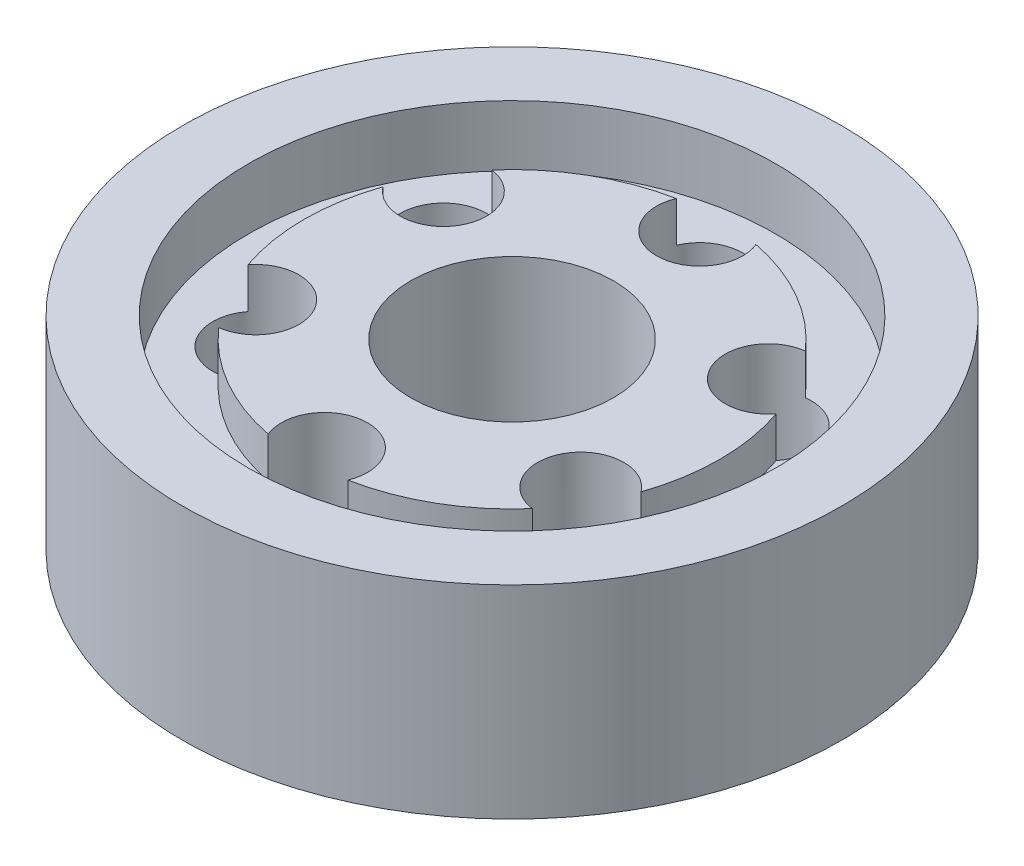
ISO-10303-21;
HEADER;
FILE_DESCRIPTION(('STEP AP214'),'2;1');
FILE_NAME('part.step','',(''),(''),'','','');
FILE_SCHEMA(('AUTOMOTIVE_DESIGN { 1 0 10303 214 1 1 1 1 }'));
ENDSEC;
DATA;
#1=APPLICATION_CONTEXT('core data for automotive mechanical design processes');
#2=APPLICATION_PROTOCOL_DEFINITION('international standard','automotive_design',2000,#1);
#3=PRODUCT_CONTEXT('',#1,'mechanical');
#4=PRODUCT('Part','Part','',(#3));
#5=PRODUCT_RELATED_PRODUCT_CATEGORY('part','',(#4));
#6=PRODUCT_DEFINITION_FORMATION('','',#4);
#7=PRODUCT_DEFINITION_CONTEXT('part definition',#1,'design');
#8=PRODUCT_DEFINITION('design','',#6,#7);
#9=PRODUCT_DEFINITION_SHAPE('','',#8);
#10=(LENGTH_UNIT() NAMED_UNIT(*) SI_UNIT(.MILLI.,.METRE.));
#11=(NAMED_UNIT(*) PLANE_ANGLE_UNIT() SI_UNIT($,.RADIAN.));
#12=(NAMED_UNIT(*) SI_UNIT($,.STERADIAN.) SOLID_ANGLE_UNIT());
#13=UNCERTAINTY_MEASURE_WITH_UNIT(LENGTH_MEASURE(1.E-05),#10,'distance_accuracy_value','');
#14=(GEOMETRIC_REPRESENTATION_CONTEXT(3) GLOBAL_UNCERTAINTY_ASSIGNED_CONTEXT((#13)) GLOBAL_UNIT_ASSIGNED_CONTEXT((#10,
#11,#12)) REPRESENTATION_CONTEXT('',''));
#15=CARTESIAN_POINT('',(0.,0.,0.));
#16=DIRECTION('',(0.,0.,1.));
#17=DIRECTION('',(1.,0.,0.));
#18=AXIS2_PLACEMENT_3D('',#15,#16,#17);
#19=CARTESIAN_POINT('',(0.,14.,0.));
#20=DIRECTION('',(0.,1.,0.));
#21=DIRECTION('',(0.,0.,1.));
#22=AXIS2_PLACEMENT_3D('',#19,#20,#21);
#23=CYLINDRICAL_SURFACE('',#22,26.);
#24=CARTESIAN_POINT('',(0.,20.,0.));
#25=DIRECTION('',(0.,1.,0.));
#26=DIRECTION('',(0.,0.,1.));
#27=AXIS2_PLACEMENT_3D('',#24,#25,#26);
#28=CIRCLE('',#27,26.);
#29=CARTESIAN_POINT('',(0.,20.,26.));
#30=VERTEX_POINT('',#29);
#31=EDGE_CURVE('E169',#30,#30,#28,.F.);
#32=ORIENTED_EDGE('',*,*,#31,.F.);
#33=EDGE_LOOP('',(#32));
#34=FACE_BOUND('',#33,.T.);
#35=CARTESIAN_POINT('',(0.,14.,0.));
#36=DIRECTION('',(0.,1.,0.));
#37=DIRECTION('',(0.,0.,1.));
#38=AXIS2_PLACEMENT_3D('',#35,#36,#37);
#39=CIRCLE('',#38,26.);
#40=CARTESIAN_POINT('',(0.,14.,26.));
#41=VERTEX_POINT('',#40);
#42=EDGE_CURVE('E211',#41,#41,#39,.T.);
#43=ORIENTED_EDGE('',*,*,#42,.F.);
#44=EDGE_LOOP('',(#43));
#45=FACE_BOUND('',#44,.T.);
#46=ADVANCED_FACE('F15',(#34,#45),#23,.F.);
#47=CARTESIAN_POINT('',(0.,18.,0.));
#48=DIRECTION('',(0.,-1.,0.));
#49=DIRECTION('',(0.,0.,-1.));
#50=AXIS2_PLACEMENT_3D('',#47,#48,#49);
#51=CYLINDRICAL_SURFACE('',#50,20.5);
#52=CARTESIAN_POINT('',(0.,18.,0.));
#53=DIRECTION('',(0.,-1.,0.));
#54=DIRECTION('',(0.,0.,-1.));
#55=AXIS2_PLACEMENT_3D('',#52,#53,#54);
#56=CIRCLE('',#55,20.5);
#57=CARTESIAN_POINT('',(-19.3889539201822,18.,-6.65721156949743));
#58=VERTEX_POINT('',#57);
#59=CARTESIAN_POINT('',(-19.3889539201821,18.,6.65721156949784));
#60=VERTEX_POINT('',#59);
#61=EDGE_CURVE('E229',#58,#60,#56,.F.);
#62=ORIENTED_EDGE('',*,*,#61,.F.);
#63=DIRECTION('',(0.,-1.,0.));
#64=VECTOR('',#63,1.);
#65=CARTESIAN_POINT('',(-19.3889539201822,0.,-6.65721156949742));
#66=LINE('',#65,#64);
#67=CARTESIAN_POINT('',(-19.3889539201822,14.,-6.65721156949743));
#68=VERTEX_POINT('',#67);
#69=EDGE_CURVE('E161',#58,#68,#66,.T.);
#70=ORIENTED_EDGE('',*,*,#69,.T.);
#71=CARTESIAN_POINT('',(0.,14.,0.));
#72=DIRECTION('',(0.,-1.,0.));
#73=DIRECTION('',(0.,0.,-1.));
#74=AXIS2_PLACEMENT_3D('',#71,#72,#73);
#75=CIRCLE('',#74,20.5);
#76=CARTESIAN_POINT('',(-19.3889539201821,14.,6.65721156949784));
#77=VERTEX_POINT('',#76);
#78=EDGE_CURVE('E224',#77,#68,#75,.T.);
#79=ORIENTED_EDGE('',*,*,#78,.F.);
#80=DIRECTION('',(0.,-1.,0.));
#81=VECTOR('',#80,1.);
#82=CARTESIAN_POINT('',(-19.3889539201821,0.,6.65721156949784));
#83=LINE('',#82,#81);
#84=EDGE_CURVE('E167',#77,#60,#83,.F.);
#85=ORIENTED_EDGE('',*,*,#84,.T.);
#86=EDGE_LOOP('',(#62,#70,#79,#85));
#87=FACE_BOUND('',#86,.T.);
#88=ADVANCED_FACE('F309',(#87),#51,.T.);
#89=CARTESIAN_POINT('',(0.,18.,0.));
#90=DIRECTION('',(0.,-1.,0.));
#91=DIRECTION('',(0.,0.,-1.));
#92=AXIS2_PLACEMENT_3D('',#89,#90,#91);
#93=CYLINDRICAL_SURFACE('',#92,20.5);
#94=CARTESIAN_POINT('',(0.,18.,0.));
#95=DIRECTION('',(0.,-1.,0.));
#96=DIRECTION('',(0.,0.,-1.));
#97=AXIS2_PLACEMENT_3D('',#94,#95,#96);
#98=CIRCLE('',#97,20.5);
#99=CARTESIAN_POINT('',(-3.92916262253848,18.,-20.1199324324324));
#100=VERTEX_POINT('',#99);
#101=CARTESIAN_POINT('',(-15.4597912976438,18.,-13.4627208629347));
#102=VERTEX_POINT('',#101);
#103=EDGE_CURVE('E231',#100,#102,#98,.F.);
#104=ORIENTED_EDGE('',*,*,#103,.F.);
#105=DIRECTION('',(0.,-1.,0.));
#106=VECTOR('',#105,1.);
#107=CARTESIAN_POINT('',(-3.92916262253848,0.,-20.1199324324324));
#108=LINE('',#107,#106);
#109=CARTESIAN_POINT('',(-3.92916262253848,14.,-20.1199324324324));
#110=VERTEX_POINT('',#109);
#111=EDGE_CURVE('E153',#100,#110,#108,.T.);
#112=ORIENTED_EDGE('',*,*,#111,.T.);
#113=CARTESIAN_POINT('',(0.,14.,0.));
#114=DIRECTION('',(0.,-1.,0.));
#115=DIRECTION('',(0.,0.,-1.));
#116=AXIS2_PLACEMENT_3D('',#113,#114,#115);
#117=CIRCLE('',#116,20.5);
#118=CARTESIAN_POINT('',(-15.4597912976438,14.,-13.4627208629347));
#119=VERTEX_POINT('',#118);
#120=EDGE_CURVE('E221',#119,#110,#117,.T.);
#121=ORIENTED_EDGE('',*,*,#120,.F.);
#122=DIRECTION('',(0.,-1.,0.));
#123=VECTOR('',#122,1.);
#124=CARTESIAN_POINT('',(-15.4597912976438,0.,-13.4627208629347));
#125=LINE('',#124,#123);
#126=EDGE_CURVE('E157',#119,#102,#125,.F.);
#127=ORIENTED_EDGE('',*,*,#126,.T.);
#128=EDGE_LOOP('',(#104,#112,#121,#127));
#129=FACE_BOUND('',#128,.T.);
#130=ADVANCED_FACE('F314',(#129),#93,.T.);
#131=CARTESIAN_POINT('',(0.,18.,0.));
#132=DIRECTION('',(0.,-1.,0.));
#133=DIRECTION('',(0.,0.,-1.));
#134=AXIS2_PLACEMENT_3D('',#131,#132,#133);
#135=CYLINDRICAL_SURFACE('',#134,20.5);
#136=CARTESIAN_POINT('',(0.,18.,0.));
#137=DIRECTION('',(0.,-1.,0.));
#138=DIRECTION('',(0.,0.,-1.));
#139=AXIS2_PLACEMENT_3D('',#136,#137,#138);
#140=CIRCLE('',#139,20.5);
#141=CARTESIAN_POINT('',(15.4597912976436,18.,-13.4627208629349));
#142=VERTEX_POINT('',#141);
#143=CARTESIAN_POINT('',(3.92916262253848,18.,-20.1199324324324));
#144=VERTEX_POINT('',#143);
#145=EDGE_CURVE('E233',#142,#144,#140,.F.);
#146=ORIENTED_EDGE('',*,*,#145,.F.);
#147=DIRECTION('',(0.,-1.,0.));
#148=VECTOR('',#147,1.);
#149=CARTESIAN_POINT('',(15.4597912976436,0.,-13.4627208629349));
#150=LINE('',#149,#148);
#151=CARTESIAN_POINT('',(15.4597912976436,14.,-13.4627208629349));
#152=VERTEX_POINT('',#151);
#153=EDGE_CURVE('E145',#142,#152,#150,.T.);
#154=ORIENTED_EDGE('',*,*,#153,.T.);
#155=CARTESIAN_POINT('',(0.,14.,0.));
#156=DIRECTION('',(0.,-1.,0.));
#157=DIRECTION('',(0.,0.,-1.));
#158=AXIS2_PLACEMENT_3D('',#155,#156,#157);
#159=CIRCLE('',#158,20.5);
#160=CARTESIAN_POINT('',(3.92916262253848,14.,-20.1199324324324));
#161=VERTEX_POINT('',#160);
#162=EDGE_CURVE('E218',#161,#152,#159,.T.);
#163=ORIENTED_EDGE('',*,*,#162,.F.);
#164=DIRECTION('',(0.,-1.,0.));
#165=VECTOR('',#164,1.);
#166=CARTESIAN_POINT('',(3.92916262253848,0.,-20.1199324324324));
#167=LINE('',#166,#165);
#168=EDGE_CURVE('E149',#161,#144,#167,.F.);
#169=ORIENTED_EDGE('',*,*,#168,.T.);
#170=EDGE_LOOP('',(#146,#154,#163,#169));
#171=FACE_BOUND('',#170,.T.);
#172=ADVANCED_FACE('F319',(#171),#135,.T.);
#173=CARTESIAN_POINT('',(0.,18.,0.));
#174=DIRECTION('',(0.,-1.,0.));
#175=DIRECTION('',(0.,0.,-1.));
#176=AXIS2_PLACEMENT_3D('',#173,#174,#175);
#177=CYLINDRICAL_SURFACE('',#176,20.5);
#178=CARTESIAN_POINT('',(0.,18.,0.));
#179=DIRECTION('',(0.,-1.,0.));
#180=DIRECTION('',(0.,0.,-1.));
#181=AXIS2_PLACEMENT_3D('',#178,#179,#180);
#182=CIRCLE('',#181,20.5);
#183=CARTESIAN_POINT('',(19.3889539201822,18.,6.65721156949756));
#184=VERTEX_POINT('',#183);
#185=CARTESIAN_POINT('',(19.3889539201821,18.,-6.65721156949769));
#186=VERTEX_POINT('',#185);
#187=EDGE_CURVE('E124',#184,#186,#182,.F.);
#188=ORIENTED_EDGE('',*,*,#187,.F.);
#189=DIRECTION('',(0.,-1.,0.));
#190=VECTOR('',#189,1.);
#191=CARTESIAN_POINT('',(19.3889539201822,0.,6.65721156949756));
#192=LINE('',#191,#190);
#193=CARTESIAN_POINT('',(19.3889539201822,14.,6.65721156949756));
#194=VERTEX_POINT('',#193);
#195=EDGE_CURVE('E133',#184,#194,#192,.T.);
#196=ORIENTED_EDGE('',*,*,#195,.T.);
#197=CARTESIAN_POINT('',(0.,14.,0.));
#198=DIRECTION('',(0.,-1.,0.));
#199=DIRECTION('',(0.,0.,-1.));
#200=AXIS2_PLACEMENT_3D('',#197,#198,#199);
#201=CIRCLE('',#200,20.5);
#202=CARTESIAN_POINT('',(19.3889539201821,14.,-6.65721156949769));
#203=VERTEX_POINT('',#202);
#204=EDGE_CURVE('E216',#203,#194,#201,.T.);
#205=ORIENTED_EDGE('',*,*,#204,.F.);
#206=DIRECTION('',(0.,-1.,0.));
#207=VECTOR('',#206,1.);
#208=CARTESIAN_POINT('',(19.3889539201821,0.,-6.65721156949769));
#209=LINE('',#208,#207);
#210=EDGE_CURVE('E141',#203,#186,#209,.F.);
#211=ORIENTED_EDGE('',*,*,#210,.T.);
#212=EDGE_LOOP('',(#188,#196,#205,#211));
#213=FACE_BOUND('',#212,.T.);
#214=ADVANCED_FACE('F243',(#213),#177,.T.);
#215=CARTESIAN_POINT('',(0.,18.,0.));
#216=DIRECTION('',(0.,-1.,0.));
#217=DIRECTION('',(0.,0.,-1.));
#218=AXIS2_PLACEMENT_3D('',#215,#216,#217);
#219=CYLINDRICAL_SURFACE('',#218,20.5);
#220=CARTESIAN_POINT('',(0.,14.,0.));
#221=DIRECTION('',(0.,-1.,0.));
#222=DIRECTION('',(0.,0.,-1.));
#223=AXIS2_PLACEMENT_3D('',#220,#221,#222);
#224=CIRCLE('',#223,20.5);
#225=CARTESIAN_POINT('',(-3.92916262253848,14.,20.1199324324324));
#226=VERTEX_POINT('',#225);
#227=CARTESIAN_POINT('',(-15.4597912976435,14.,13.462720862935));
#228=VERTEX_POINT('',#227);
#229=EDGE_CURVE('E102',#226,#228,#224,.T.);
#230=ORIENTED_EDGE('',*,*,#229,.F.);
#231=DIRECTION('',(0.,-1.,0.));
#232=VECTOR('',#231,1.);
#233=CARTESIAN_POINT('',(-3.92916262253848,0.,20.1199324324324));
#234=LINE('',#233,#232);
#235=CARTESIAN_POINT('',(-3.92916262253848,18.,20.1199324324324));
#236=VERTEX_POINT('',#235);
#237=EDGE_CURVE('E114',#226,#236,#234,.F.);
#238=ORIENTED_EDGE('',*,*,#237,.T.);
#239=CARTESIAN_POINT('',(0.,18.,0.));
#240=DIRECTION('',(0.,-1.,0.));
#241=DIRECTION('',(0.,0.,-1.));
#242=AXIS2_PLACEMENT_3D('',#239,#240,#241);
#243=CIRCLE('',#242,20.5);
#244=CARTESIAN_POINT('',(-15.4597912976435,18.,13.462720862935));
#245=VERTEX_POINT('',#244);
#246=EDGE_CURVE('E18',#245,#236,#243,.F.);
#247=ORIENTED_EDGE('',*,*,#246,.F.);
#248=DIRECTION('',(0.,-1.,0.));
#249=VECTOR('',#248,1.);
#250=CARTESIAN_POINT('',(-15.4597912976435,0.,13.462720862935));
#251=LINE('',#250,#249);
#252=EDGE_CURVE('E165',#245,#228,#251,.T.);
#253=ORIENTED_EDGE('',*,*,#252,.T.);
#254=EDGE_LOOP('',(#230,#238,#247,#253));
#255=FACE_BOUND('',#254,.T.);
#256=ADVANCED_FACE('F125',(#255),#219,.T.);
#257=CARTESIAN_POINT('',(0.,18.,0.));
#258=DIRECTION('',(0.,1.,0.));
#259=DIRECTION('',(0.,0.,1.));
#260=AXIS2_PLACEMENT_3D('',#257,#258,#259);
#261=PLANE('',#260);
#262=CARTESIAN_POINT('',(0.,18.,0.));
#263=DIRECTION('',(0.,-1.,0.));
#264=DIRECTION('',(0.,0.,-1.));
#265=AXIS2_PLACEMENT_3D('',#262,#263,#264);
#266=CIRCLE('',#265,10.);
#267=CARTESIAN_POINT('',(0.,18.,-10.));
#268=VERTEX_POINT('',#267);
#269=EDGE_CURVE('E126',#268,#268,#266,.T.);
#270=ORIENTED_EDGE('',*,*,#269,.T.);
#271=EDGE_LOOP('',(#270));
#272=FACE_BOUND('',#271,.T.);
#273=ORIENTED_EDGE('',*,*,#61,.T.);
#274=CARTESIAN_POINT('',(-16.021469970012,18.,9.25000000000019));
#275=DIRECTION('',(0.,-1.,0.));
#276=DIRECTION('',(0.,0.,-1.));
#277=AXIS2_PLACEMENT_3D('',#274,#275,#276);
#278=CIRCLE('',#277,4.24999999999999);
#279=EDGE_CURVE('E123',#60,#245,#278,.T.);
#280=ORIENTED_EDGE('',*,*,#279,.T.);
#281=ORIENTED_EDGE('',*,*,#246,.T.);
#282=CARTESIAN_POINT('',(0.,18.,18.5));
#283=DIRECTION('',(0.,-1.,0.));
#284=DIRECTION('',(0.,0.,-1.));
#285=AXIS2_PLACEMENT_3D('',#282,#283,#284);
#286=CIRCLE('',#285,4.24999999999999);
#287=CARTESIAN_POINT('',(3.92916262253848,18.,20.1199324324324));
#288=VERTEX_POINT('',#287);
#289=EDGE_CURVE('E111',#236,#288,#286,.T.);
#290=ORIENTED_EDGE('',*,*,#289,.T.);
#291=CARTESIAN_POINT('',(0.,18.,0.));
#292=DIRECTION('',(0.,-1.,0.));
#293=DIRECTION('',(0.,0.,-1.));
#294=AXIS2_PLACEMENT_3D('',#291,#292,#293);
#295=CIRCLE('',#294,20.5);
#296=CARTESIAN_POINT('',(15.4597912976437,18.,13.4627208629348));
#297=VERTEX_POINT('',#296);
#298=EDGE_CURVE('E227',#297,#288,#295,.T.);
#299=ORIENTED_EDGE('',*,*,#298,.F.);
#300=CARTESIAN_POINT('',(16.0214699700121,18.,9.24999999999996));
#301=DIRECTION('',(0.,-1.,0.));
#302=DIRECTION('',(0.,0.,-1.));
#303=AXIS2_PLACEMENT_3D('',#300,#301,#302);
#304=CIRCLE('',#303,4.24999999999999);
#305=EDGE_CURVE('E136',#297,#184,#304,.T.);
#306=ORIENTED_EDGE('',*,*,#305,.T.);
#307=ORIENTED_EDGE('',*,*,#187,.T.);
#308=CARTESIAN_POINT('',(16.0214699700121,18.,-9.25000000000008));
#309=DIRECTION('',(0.,-1.,0.));
#310=DIRECTION('',(0.,0.,-1.));
#311=AXIS2_PLACEMENT_3D('',#308,#309,#310);
#312=CIRCLE('',#311,4.24999999999999);
#313=EDGE_CURVE('E140',#186,#142,#312,.T.);
#314=ORIENTED_EDGE('',*,*,#313,.T.);
#315=ORIENTED_EDGE('',*,*,#145,.T.);
#316=CARTESIAN_POINT('',(0.,18.,-18.5));
#317=DIRECTION('',(0.,-1.,0.));
#318=DIRECTION('',(0.,0.,-1.));
#319=AXIS2_PLACEMENT_3D('',#316,#317,#318);
#320=CIRCLE('',#319,4.24999999999999);
#321=EDGE_CURVE('E148',#144,#100,#320,.T.);
#322=ORIENTED_EDGE('',*,*,#321,.T.);
#323=ORIENTED_EDGE('',*,*,#103,.T.);
#324=CARTESIAN_POINT('',(-16.0214699700122,18.,-9.24999999999985));
#325=DIRECTION('',(0.,-1.,0.));
#326=DIRECTION('',(0.,0.,-1.));
#327=AXIS2_PLACEMENT_3D('',#324,#325,#326);
#328=CIRCLE('',#327,4.24999999999999);
#329=EDGE_CURVE('E156',#102,#58,#328,.T.);
#330=ORIENTED_EDGE('',*,*,#329,.T.);
#331=EDGE_LOOP('',(#273,#280,#281,#290,#299,#306,#307,#314,#315,#322,#323,#330));
#332=FACE_BOUND('',#331,.T.);
#333=ADVANCED_FACE('F122',(#272,#332),#261,.T.);
#334=CARTESIAN_POINT('',(0.,18.,0.));
#335=DIRECTION('',(0.,-1.,0.));
#336=DIRECTION('',(0.,0.,-1.));
#337=AXIS2_PLACEMENT_3D('',#334,#335,#336);
#338=CYLINDRICAL_SURFACE('',#337,20.5);
#339=ORIENTED_EDGE('',*,*,#298,.T.);
#340=DIRECTION('',(0.,-1.,0.));
#341=VECTOR('',#340,1.);
#342=CARTESIAN_POINT('',(3.92916262253848,0.,20.1199324324324));
#343=LINE('',#342,#341);
#344=CARTESIAN_POINT('',(3.92916262253848,14.,20.1199324324324));
#345=VERTEX_POINT('',#344);
#346=EDGE_CURVE('E116',#288,#345,#343,.T.);
#347=ORIENTED_EDGE('',*,*,#346,.T.);
#348=CARTESIAN_POINT('',(0.,14.,0.));
#349=DIRECTION('',(0.,-1.,0.));
#350=DIRECTION('',(0.,0.,-1.));
#351=AXIS2_PLACEMENT_3D('',#348,#349,#350);
#352=CIRCLE('',#351,20.5);
#353=CARTESIAN_POINT('',(15.4597912976437,14.,13.4627208629348));
#354=VERTEX_POINT('',#353);
#355=EDGE_CURVE('E33',#354,#345,#352,.T.);
#356=ORIENTED_EDGE('',*,*,#355,.F.);
#357=DIRECTION('',(0.,-1.,0.));
#358=VECTOR('',#357,1.);
#359=CARTESIAN_POINT('',(15.4597912976437,0.,13.4627208629348));
#360=LINE('',#359,#358);
#361=EDGE_CURVE('E137',#354,#297,#360,.F.);
#362=ORIENTED_EDGE('',*,*,#361,.T.);
#363=EDGE_LOOP('',(#339,#347,#356,#362));
#364=FACE_BOUND('',#363,.T.);
#365=ADVANCED_FACE('F251',(#364),#338,.T.);
#366=CARTESIAN_POINT('',(0.,14.,0.));
#367=DIRECTION('',(0.,1.,0.));
#368=DIRECTION('',(0.,0.,1.));
#369=AXIS2_PLACEMENT_3D('',#366,#367,#368);
#370=PLANE('',#369);
#371=ORIENTED_EDGE('',*,*,#42,.T.);
#372=EDGE_LOOP('',(#371));
#373=FACE_BOUND('',#372,.T.);
#374=ORIENTED_EDGE('',*,*,#229,.T.);
#375=CARTESIAN_POINT('',(-16.021469970012,14.,9.25000000000019));
#376=DIRECTION('',(0.,-1.,0.));
#377=DIRECTION('',(0.,0.,-1.));
#378=AXIS2_PLACEMENT_3D('',#375,#376,#377);
#379=CIRCLE('',#378,4.24999999999999);
#380=EDGE_CURVE('E164',#228,#77,#379,.T.);
#381=ORIENTED_EDGE('',*,*,#380,.T.);
#382=ORIENTED_EDGE('',*,*,#78,.T.);
#383=CARTESIAN_POINT('',(-16.0214699700122,14.,-9.24999999999985));
#384=DIRECTION('',(0.,-1.,0.));
#385=DIRECTION('',(0.,0.,-1.));
#386=AXIS2_PLACEMENT_3D('',#383,#384,#385);
#387=CIRCLE('',#386,4.24999999999999);
#388=EDGE_CURVE('E160',#68,#119,#387,.T.);
#389=ORIENTED_EDGE('',*,*,#388,.T.);
#390=ORIENTED_EDGE('',*,*,#120,.T.);
#391=CARTESIAN_POINT('',(0.,14.,-18.5));
#392=DIRECTION('',(0.,-1.,0.));
#393=DIRECTION('',(0.,0.,-1.));
#394=AXIS2_PLACEMENT_3D('',#391,#392,#393);
#395=CIRCLE('',#394,4.24999999999999);
#396=EDGE_CURVE('E152',#110,#161,#395,.T.);
#397=ORIENTED_EDGE('',*,*,#396,.T.);
#398=ORIENTED_EDGE('',*,*,#162,.T.);
#399=CARTESIAN_POINT('',(16.0214699700121,14.,-9.25000000000008));
#400=DIRECTION('',(0.,-1.,0.));
#401=DIRECTION('',(0.,0.,-1.));
#402=AXIS2_PLACEMENT_3D('',#399,#400,#401);
#403=CIRCLE('',#402,4.24999999999999);
#404=EDGE_CURVE('E144',#152,#203,#403,.T.);
#405=ORIENTED_EDGE('',*,*,#404,.T.);
#406=ORIENTED_EDGE('',*,*,#204,.T.);
#407=CARTESIAN_POINT('',(16.0214699700121,14.,9.24999999999996));
#408=DIRECTION('',(0.,-1.,0.));
#409=DIRECTION('',(0.,0.,-1.));
#410=AXIS2_PLACEMENT_3D('',#407,#408,#409);
#411=CIRCLE('',#410,4.24999999999999);
#412=EDGE_CURVE('E129',#194,#354,#411,.T.);
#413=ORIENTED_EDGE('',*,*,#412,.T.);
#414=ORIENTED_EDGE('',*,*,#355,.T.);
#415=CARTESIAN_POINT('',(0.,14.,18.5));
#416=DIRECTION('',(0.,-1.,0.));
#417=DIRECTION('',(0.,0.,-1.));
#418=AXIS2_PLACEMENT_3D('',#415,#416,#417);
#419=CIRCLE('',#418,4.24999999999999);
#420=EDGE_CURVE('E105',#345,#226,#419,.T.);
#421=ORIENTED_EDGE('',*,*,#420,.T.);
#422=EDGE_LOOP('',(#374,#381,#382,#389,#390,#397,#398,#405,#406,#413,#414,#421));
#423=FACE_BOUND('',#422,.T.);
#424=ADVANCED_FACE('F245',(#373,#423),#370,.T.);
#425=CARTESIAN_POINT('',(0.,20.,0.));
#426=DIRECTION('',(0.,1.,0.));
#427=DIRECTION('',(0.,0.,1.));
#428=AXIS2_PLACEMENT_3D('',#425,#426,#427);
#429=PLANE('',#428);
#430=CARTESIAN_POINT('',(0.,20.,0.));
#431=DIRECTION('',(0.,-1.,0.));
#432=DIRECTION('',(0.,0.,-1.));
#433=AXIS2_PLACEMENT_3D('',#430,#431,#432);
#434=CIRCLE('',#433,32.5);
#435=CARTESIAN_POINT('',(0.,20.,-32.5));
#436=VERTEX_POINT('',#435);
#437=EDGE_CURVE('E191',#436,#436,#434,.T.);
#438=ORIENTED_EDGE('',*,*,#437,.F.);
#439=EDGE_LOOP('',(#438));
#440=FACE_BOUND('',#439,.T.);
#441=ORIENTED_EDGE('',*,*,#31,.T.);
#442=EDGE_LOOP('',(#441));
#443=FACE_BOUND('',#442,.T.);
#444=ADVANCED_FACE('F259',(#440,#443),#429,.T.);
#445=CARTESIAN_POINT('',(-16.021469970012,0.,9.25000000000019));
#446=DIRECTION('',(0.,-1.,0.));
#447=DIRECTION('',(0.,0.,-1.));
#448=AXIS2_PLACEMENT_3D('',#445,#446,#447);
#449=CYLINDRICAL_SURFACE('',#448,4.24999999999999);
#450=ORIENTED_EDGE('',*,*,#279,.F.);
#451=ORIENTED_EDGE('',*,*,#84,.F.);
#452=ORIENTED_EDGE('',*,*,#380,.F.);
#453=ORIENTED_EDGE('',*,*,#252,.F.);
#454=EDGE_LOOP('',(#450,#451,#452,#453));
#455=FACE_BOUND('',#454,.T.);
#456=CARTESIAN_POINT('',(-16.021469970012,0.,9.25000000000019));
#457=DIRECTION('',(0.,-1.,0.));
#458=DIRECTION('',(0.,0.,-1.));
#459=AXIS2_PLACEMENT_3D('',#456,#457,#458);
#460=CIRCLE('',#459,4.24999999999999);
#461=CARTESIAN_POINT('',(-16.021469970012,0.,5.0000000000002));
#462=VERTEX_POINT('',#461);
#463=EDGE_CURVE('E188',#462,#462,#460,.T.);
#464=ORIENTED_EDGE('',*,*,#463,.T.);
#465=EDGE_LOOP('',(#464));
#466=FACE_BOUND('',#465,.T.);
#467=ADVANCED_FACE('F294',(#455,#466),#449,.F.);
#468=CARTESIAN_POINT('',(-16.0214699700122,0.,-9.24999999999985));
#469=DIRECTION('',(0.,-1.,0.));
#470=DIRECTION('',(0.,0.,-1.));
#471=AXIS2_PLACEMENT_3D('',#468,#469,#470);
#472=CYLINDRICAL_SURFACE('',#471,4.24999999999999);
#473=ORIENTED_EDGE('',*,*,#388,.F.);
#474=ORIENTED_EDGE('',*,*,#69,.F.);
#475=ORIENTED_EDGE('',*,*,#329,.F.);
#476=ORIENTED_EDGE('',*,*,#126,.F.);
#477=EDGE_LOOP('',(#473,#474,#475,#476));
#478=FACE_BOUND('',#477,.T.);
#479=CARTESIAN_POINT('',(-16.0214699700122,0.,-9.24999999999985));
#480=DIRECTION('',(0.,-1.,0.));
#481=DIRECTION('',(0.,0.,-1.));
#482=AXIS2_PLACEMENT_3D('',#479,#480,#481);
#483=CIRCLE('',#482,4.24999999999999);
#484=CARTESIAN_POINT('',(-16.0214699700122,0.,-13.4999999999998));
#485=VERTEX_POINT('',#484);
#486=EDGE_CURVE('E185',#485,#485,#483,.T.);
#487=ORIENTED_EDGE('',*,*,#486,.T.);
#488=EDGE_LOOP('',(#487));
#489=FACE_BOUND('',#488,.T.);
#490=ADVANCED_FACE('F290',(#478,#489),#472,.F.);
#491=CARTESIAN_POINT('',(0.,0.,-18.5));
#492=DIRECTION('',(0.,-1.,0.));
#493=DIRECTION('',(0.,0.,-1.));
#494=AXIS2_PLACEMENT_3D('',#491,#492,#493);
#495=CYLINDRICAL_SURFACE('',#494,4.24999999999999);
#496=ORIENTED_EDGE('',*,*,#396,.F.);
#497=ORIENTED_EDGE('',*,*,#111,.F.);
#498=ORIENTED_EDGE('',*,*,#321,.F.);
#499=ORIENTED_EDGE('',*,*,#168,.F.);
#500=EDGE_LOOP('',(#496,#497,#498,#499));
#501=FACE_BOUND('',#500,.T.);
#502=CARTESIAN_POINT('',(0.,0.,-18.5));
#503=DIRECTION('',(0.,-1.,0.));
#504=DIRECTION('',(0.,0.,-1.));
#505=AXIS2_PLACEMENT_3D('',#502,#503,#504);
#506=CIRCLE('',#505,4.24999999999999);
#507=CARTESIAN_POINT('',(0.,0.,-22.75));
#508=VERTEX_POINT('',#507);
#509=EDGE_CURVE('E182',#508,#508,#506,.T.);
#510=ORIENTED_EDGE('',*,*,#509,.T.);
#511=EDGE_LOOP('',(#510));
#512=FACE_BOUND('',#511,.T.);
#513=ADVANCED_FACE('F287',(#501,#512),#495,.F.);
#514=CARTESIAN_POINT('',(16.0214699700121,0.,-9.25000000000008));
#515=DIRECTION('',(0.,-1.,0.));
#516=DIRECTION('',(0.,0.,-1.));
#517=AXIS2_PLACEMENT_3D('',#514,#515,#516);
#518=CYLINDRICAL_SURFACE('',#517,4.24999999999999);
#519=ORIENTED_EDGE('',*,*,#404,.F.);
#520=ORIENTED_EDGE('',*,*,#153,.F.);
#521=ORIENTED_EDGE('',*,*,#313,.F.);
#522=ORIENTED_EDGE('',*,*,#210,.F.);
#523=EDGE_LOOP('',(#519,#520,#521,#522));
#524=FACE_BOUND('',#523,.T.);
#525=CARTESIAN_POINT('',(16.0214699700121,0.,-9.25000000000008));
#526=DIRECTION('',(0.,-1.,0.));
#527=DIRECTION('',(0.,0.,-1.));
#528=AXIS2_PLACEMENT_3D('',#525,#526,#527);
#529=CIRCLE('',#528,4.24999999999999);
#530=CARTESIAN_POINT('',(16.0214699700121,0.,-13.5000000000001));
#531=VERTEX_POINT('',#530);
#532=EDGE_CURVE('E179',#531,#531,#529,.T.);
#533=ORIENTED_EDGE('',*,*,#532,.T.);
#534=EDGE_LOOP('',(#533));
#535=FACE_BOUND('',#534,.T.);
#536=ADVANCED_FACE('F240',(#524,#535),#518,.F.);
#537=CARTESIAN_POINT('',(16.0214699700121,0.,9.24999999999996));
#538=DIRECTION('',(0.,-1.,0.));
#539=DIRECTION('',(0.,0.,-1.));
#540=AXIS2_PLACEMENT_3D('',#537,#538,#539);
#541=CYLINDRICAL_SURFACE('',#540,4.24999999999999);
#542=ORIENTED_EDGE('',*,*,#305,.F.);
#543=ORIENTED_EDGE('',*,*,#361,.F.);
#544=ORIENTED_EDGE('',*,*,#412,.F.);
#545=ORIENTED_EDGE('',*,*,#195,.F.);
#546=EDGE_LOOP('',(#542,#543,#544,#545));
#547=FACE_BOUND('',#546,.T.);
#548=CARTESIAN_POINT('',(16.0214699700121,0.,9.24999999999996));
#549=DIRECTION('',(0.,-1.,0.));
#550=DIRECTION('',(0.,0.,-1.));
#551=AXIS2_PLACEMENT_3D('',#548,#549,#550);
#552=CIRCLE('',#551,4.24999999999999);
#553=CARTESIAN_POINT('',(16.0214699700121,0.,4.99999999999997));
#554=VERTEX_POINT('',#553);
#555=EDGE_CURVE('E176',#554,#554,#552,.T.);
#556=ORIENTED_EDGE('',*,*,#555,.T.);
#557=EDGE_LOOP('',(#556));
#558=FACE_BOUND('',#557,.T.);
#559=ADVANCED_FACE('F248',(#547,#558),#541,.F.);
#560=CARTESIAN_POINT('',(0.,20.,0.));
#561=DIRECTION('',(0.,-1.,0.));
#562=DIRECTION('',(0.,0.,-1.));
#563=AXIS2_PLACEMENT_3D('',#560,#561,#562);
#564=CYLINDRICAL_SURFACE('',#563,10.);
#565=ORIENTED_EDGE('',*,*,#269,.F.);
#566=EDGE_LOOP('',(#565));
#567=FACE_BOUND('',#566,.T.);
#568=CARTESIAN_POINT('',(0.,0.,0.));
#569=DIRECTION('',(0.,-1.,0.));
#570=DIRECTION('',(0.,0.,-1.));
#571=AXIS2_PLACEMENT_3D('',#568,#569,#570);
#572=CIRCLE('',#571,10.);
#573=CARTESIAN_POINT('',(0.,0.,-10.));
#574=VERTEX_POINT('',#573);
#575=EDGE_CURVE('E173',#574,#574,#572,.T.);
#576=ORIENTED_EDGE('',*,*,#575,.T.);
#577=EDGE_LOOP('',(#576));
#578=FACE_BOUND('',#577,.T.);
#579=ADVANCED_FACE('F279',(#567,#578),#564,.F.);
#580=CARTESIAN_POINT('',(0.,0.,18.5));
#581=DIRECTION('',(0.,-1.,0.));
#582=DIRECTION('',(0.,0.,-1.));
#583=AXIS2_PLACEMENT_3D('',#580,#581,#582);
#584=CYLINDRICAL_SURFACE('',#583,4.24999999999999);
#585=ORIENTED_EDGE('',*,*,#289,.F.);
#586=ORIENTED_EDGE('',*,*,#237,.F.);
#587=ORIENTED_EDGE('',*,*,#420,.F.);
#588=ORIENTED_EDGE('',*,*,#346,.F.);
#589=EDGE_LOOP('',(#585,#586,#587,#588));
#590=FACE_BOUND('',#589,.T.);
#591=CARTESIAN_POINT('',(0.,0.,18.5));
#592=DIRECTION('',(0.,-1.,0.));
#593=DIRECTION('',(0.,0.,-1.));
#594=AXIS2_PLACEMENT_3D('',#591,#592,#593);
#595=CIRCLE('',#594,4.24999999999999);
#596=CARTESIAN_POINT('',(0.,0.,14.25));
#597=VERTEX_POINT('',#596);
#598=EDGE_CURVE('E24',#597,#597,#595,.T.);
#599=ORIENTED_EDGE('',*,*,#598,.T.);
#600=EDGE_LOOP('',(#599));
#601=FACE_BOUND('',#600,.T.);
#602=ADVANCED_FACE('F112',(#590,#601),#584,.F.);
#603=CARTESIAN_POINT('',(0.,20.,0.));
#604=DIRECTION('',(0.,-1.,0.));
#605=DIRECTION('',(0.,0.,-1.));
#606=AXIS2_PLACEMENT_3D('',#603,#604,#605);
#607=CYLINDRICAL_SURFACE('',#606,32.5);
#608=ORIENTED_EDGE('',*,*,#437,.T.);
#609=EDGE_LOOP('',(#608));
#610=FACE_BOUND('',#609,.T.);
#611=CARTESIAN_POINT('',(0.,0.,0.));
#612=DIRECTION('',(0.,-1.,0.));
#613=DIRECTION('',(0.,0.,-1.));
#614=AXIS2_PLACEMENT_3D('',#611,#612,#613);
#615=CIRCLE('',#614,32.5);
#616=CARTESIAN_POINT('',(0.,0.,-32.5));
#617=VERTEX_POINT('',#616);
#618=EDGE_CURVE('E9',#617,#617,#615,.F.);
#619=ORIENTED_EDGE('',*,*,#618,.T.);
#620=EDGE_LOOP('',(#619));
#621=FACE_BOUND('',#620,.T.);
#622=ADVANCED_FACE('F266',(#610,#621),#607,.T.);
#623=CARTESIAN_POINT('',(0.,0.,0.));
#624=DIRECTION('',(0.,1.,0.));
#625=DIRECTION('',(0.,0.,1.));
#626=AXIS2_PLACEMENT_3D('',#623,#624,#625);
#627=PLANE('',#626);
#628=ORIENTED_EDGE('',*,*,#618,.F.);
#629=EDGE_LOOP('',(#628));
#630=FACE_BOUND('',#629,.T.);
#631=ORIENTED_EDGE('',*,*,#598,.F.);
#632=EDGE_LOOP('',(#631));
#633=FACE_BOUND('',#632,.T.);
#634=ORIENTED_EDGE('',*,*,#575,.F.);
#635=EDGE_LOOP('',(#634));
#636=FACE_BOUND('',#635,.T.);
#637=ORIENTED_EDGE('',*,*,#555,.F.);
#638=EDGE_LOOP('',(#637));
#639=FACE_BOUND('',#638,.T.);
#640=ORIENTED_EDGE('',*,*,#532,.F.);
#641=EDGE_LOOP('',(#640));
#642=FACE_BOUND('',#641,.T.);
#643=ORIENTED_EDGE('',*,*,#509,.F.);
#644=EDGE_LOOP('',(#643));
#645=FACE_BOUND('',#644,.T.);
#646=ORIENTED_EDGE('',*,*,#486,.F.);
#647=EDGE_LOOP('',(#646));
#648=FACE_BOUND('',#647,.T.);
#649=ORIENTED_EDGE('',*,*,#463,.F.);
#650=EDGE_LOOP('',(#649));
#651=FACE_BOUND('',#650,.T.);
#652=ADVANCED_FACE('F264',(#630,#633,#636,#639,#642,#645,#648,#651),#627,.F.);
#653=CLOSED_SHELL('',(#46,#88,#130,#172,#214,#256,#333,#365,#424,#444,#467,#490,#513,#536,#559,
#579,#602,#622,#652));
#654=MANIFOLD_SOLID_BREP('B1',#653);
#655=ADVANCED_BREP_SHAPE_REPRESENTATION('',(#18,#654),#14);
#656=SHAPE_DEFINITION_REPRESENTATION(#9,#655);
ENDSEC;
END-ISO-10303-21;
